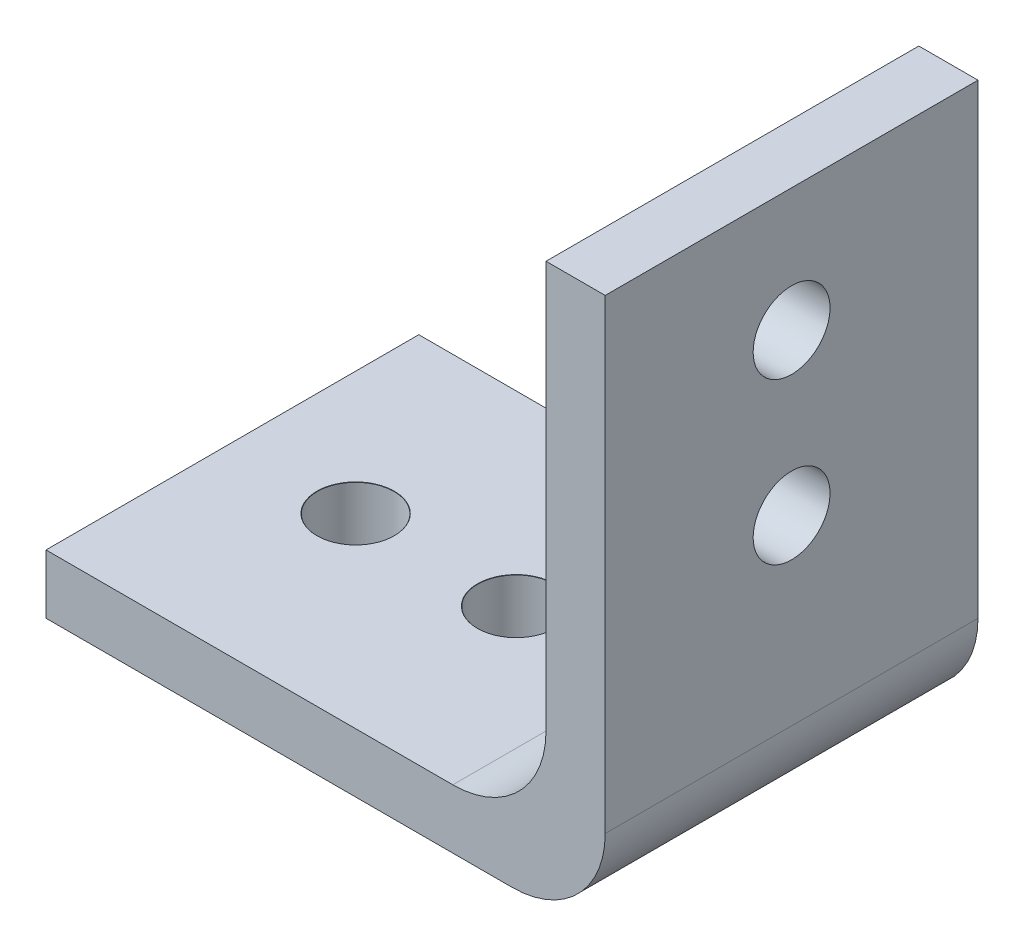
ISO-10303-21;
HEADER;
FILE_DESCRIPTION(('STEP AP214'),'2;1');
FILE_NAME('part.step','',(''),(''),'','','');
FILE_SCHEMA(('AUTOMOTIVE_DESIGN { 1 0 10303 214 1 1 1 1 }'));
ENDSEC;
DATA;
#1=APPLICATION_CONTEXT('core data for automotive mechanical design processes');
#2=APPLICATION_PROTOCOL_DEFINITION('international standard','automotive_design',2000,#1);
#3=PRODUCT_CONTEXT('',#1,'mechanical');
#4=PRODUCT('Part','Part','',(#3));
#5=PRODUCT_RELATED_PRODUCT_CATEGORY('part','',(#4));
#6=PRODUCT_DEFINITION_FORMATION('','',#4);
#7=PRODUCT_DEFINITION_CONTEXT('part definition',#1,'design');
#8=PRODUCT_DEFINITION('design','',#6,#7);
#9=PRODUCT_DEFINITION_SHAPE('','',#8);
#10=(LENGTH_UNIT() NAMED_UNIT(*) SI_UNIT(.MILLI.,.METRE.));
#11=(NAMED_UNIT(*) PLANE_ANGLE_UNIT() SI_UNIT($,.RADIAN.));
#12=(NAMED_UNIT(*) SI_UNIT($,.STERADIAN.) SOLID_ANGLE_UNIT());
#13=UNCERTAINTY_MEASURE_WITH_UNIT(LENGTH_MEASURE(1.E-05),#10,'distance_accuracy_value','');
#14=(GEOMETRIC_REPRESENTATION_CONTEXT(3) GLOBAL_UNCERTAINTY_ASSIGNED_CONTEXT((#13)) GLOBAL_UNIT_ASSIGNED_CONTEXT((#10,
#11,#12)) REPRESENTATION_CONTEXT('',''));
#15=CARTESIAN_POINT('',(0.,0.,0.));
#16=DIRECTION('',(0.,0.,1.));
#17=DIRECTION('',(1.,0.,0.));
#18=AXIS2_PLACEMENT_3D('',#15,#16,#17);
#19=CARTESIAN_POINT('',(-18.3870949784862,6.35,-16.4043299690679));
#20=DIRECTION('',(1.,0.,0.));
#21=DIRECTION('',(0.,0.,-1.));
#22=AXIS2_PLACEMENT_3D('',#19,#20,#21);
#23=PLANE('',#22);
#24=DIRECTION('',(0.,0.,1.));
#25=VECTOR('',#24,1.);
#26=CARTESIAN_POINT('',(-18.3870949784862,0.,-16.4043299690679));
#27=LINE('',#26,#25);
#28=CARTESIAN_POINT('',(-18.3870949784862,0.,-16.4043299690679));
#29=VERTEX_POINT('',#28);
#30=CARTESIAN_POINT('',(-18.3870949784862,0.,23.5956700309321));
#31=VERTEX_POINT('',#30);
#32=EDGE_CURVE('E149',#29,#31,#27,.T.);
#33=ORIENTED_EDGE('',*,*,#32,.T.);
#34=DIRECTION('',(0.,-1.,0.));
#35=VECTOR('',#34,1.);
#36=CARTESIAN_POINT('',(-18.3870949784862,6.35,23.5956700309321));
#37=LINE('',#36,#35);
#38=CARTESIAN_POINT('',(-18.3870949784862,6.35,23.5956700309321));
#39=VERTEX_POINT('',#38);
#40=EDGE_CURVE('E117',#39,#31,#37,.T.);
#41=ORIENTED_EDGE('',*,*,#40,.F.);
#42=DIRECTION('',(0.,0.,1.));
#43=VECTOR('',#42,1.);
#44=CARTESIAN_POINT('',(-18.3870949784862,6.35,-16.4043299690679));
#45=LINE('',#44,#43);
#46=CARTESIAN_POINT('',(-18.3870949784862,6.35,-16.4043299690679));
#47=VERTEX_POINT('',#46);
#48=EDGE_CURVE('E150',#47,#39,#45,.T.);
#49=ORIENTED_EDGE('',*,*,#48,.F.);
#50=DIRECTION('',(0.,-1.,0.));
#51=VECTOR('',#50,1.);
#52=CARTESIAN_POINT('',(-18.3870949784862,6.35,-16.4043299690679));
#53=LINE('',#52,#51);
#54=EDGE_CURVE('E162',#47,#29,#53,.T.);
#55=ORIENTED_EDGE('',*,*,#54,.T.);
#56=EDGE_LOOP('',(#33,#41,#49,#55));
#57=FACE_BOUND('',#56,.T.);
#58=ADVANCED_FACE('F42',(#57),#23,.F.);
#59=CARTESIAN_POINT('',(-18.3870949784862,6.35,23.5956700309321));
#60=DIRECTION('',(0.,0.,-1.));
#61=DIRECTION('',(-1.,0.,0.));
#62=AXIS2_PLACEMENT_3D('',#59,#60,#61);
#63=PLANE('',#62);
#64=DIRECTION('',(1.,0.,0.));
#65=VECTOR('',#64,1.);
#66=CARTESIAN_POINT('',(-18.3870949784862,0.,23.5956700309321));
#67=LINE('',#66,#65);
#68=CARTESIAN_POINT('',(31.6129050215138,0.,23.5956700309321));
#69=VERTEX_POINT('',#68);
#70=EDGE_CURVE('E166',#31,#69,#67,.T.);
#71=ORIENTED_EDGE('',*,*,#70,.T.);
#72=CARTESIAN_POINT('',(31.6129050215138,10.,23.5956700309321));
#73=DIRECTION('',(0.,0.,-1.));
#74=DIRECTION('',(-1.,0.,0.));
#75=AXIS2_PLACEMENT_3D('',#72,#73,#74);
#76=CIRCLE('',#75,10.);
#77=CARTESIAN_POINT('',(41.6129050215138,10.,23.5956700309321));
#78=VERTEX_POINT('',#77);
#79=EDGE_CURVE('E11',#69,#78,#76,.F.);
#80=ORIENTED_EDGE('',*,*,#79,.T.);
#81=DIRECTION('',(0.,-1.,0.));
#82=VECTOR('',#81,1.);
#83=CARTESIAN_POINT('',(41.6129050215138,6.35,23.5956700309321));
#84=LINE('',#83,#82);
#85=CARTESIAN_POINT('',(41.6129050215138,60.,23.5956700309321));
#86=VERTEX_POINT('',#85);
#87=EDGE_CURVE('E106',#86,#78,#84,.T.);
#88=ORIENTED_EDGE('',*,*,#87,.F.);
#89=DIRECTION('',(1.,0.,0.));
#90=VECTOR('',#89,1.);
#91=CARTESIAN_POINT('',(35.2629050215138,60.,23.5956700309321));
#92=LINE('',#91,#90);
#93=CARTESIAN_POINT('',(35.2629050215138,60.,23.5956700309321));
#94=VERTEX_POINT('',#93);
#95=EDGE_CURVE('E110',#94,#86,#92,.T.);
#96=ORIENTED_EDGE('',*,*,#95,.F.);
#97=DIRECTION('',(0.,-1.,0.));
#98=VECTOR('',#97,1.);
#99=CARTESIAN_POINT('',(35.2629050215138,60.,23.5956700309321));
#100=LINE('',#99,#98);
#101=CARTESIAN_POINT('',(35.2629050215138,16.35,23.5956700309321));
#102=VERTEX_POINT('',#101);
#103=EDGE_CURVE('E142',#94,#102,#100,.T.);
#104=ORIENTED_EDGE('',*,*,#103,.T.);
#105=CARTESIAN_POINT('',(25.2629050215138,16.35,23.5956700309321));
#106=DIRECTION('',(0.,0.,-1.));
#107=DIRECTION('',(-1.,0.,0.));
#108=AXIS2_PLACEMENT_3D('',#105,#106,#107);
#109=CIRCLE('',#108,10.);
#110=CARTESIAN_POINT('',(25.2629050215138,6.35,23.5956700309321));
#111=VERTEX_POINT('',#110);
#112=EDGE_CURVE('E186',#102,#111,#109,.T.);
#113=ORIENTED_EDGE('',*,*,#112,.T.);
#114=DIRECTION('',(1.,0.,0.));
#115=VECTOR('',#114,1.);
#116=CARTESIAN_POINT('',(-18.3870949784862,6.35,23.5956700309321));
#117=LINE('',#116,#115);
#118=EDGE_CURVE('E154',#39,#111,#117,.T.);
#119=ORIENTED_EDGE('',*,*,#118,.F.);
#120=ORIENTED_EDGE('',*,*,#40,.T.);
#121=EDGE_LOOP('',(#71,#80,#88,#96,#104,#113,#119,#120));
#122=FACE_BOUND('',#121,.T.);
#123=ADVANCED_FACE('F108',(#122),#63,.F.);
#124=CARTESIAN_POINT('',(41.6129050215138,6.35,-16.4043299690679));
#125=DIRECTION('',(-1.,0.,0.));
#126=DIRECTION('',(0.,0.,1.));
#127=AXIS2_PLACEMENT_3D('',#124,#125,#126);
#128=PLANE('',#127);
#129=CARTESIAN_POINT('',(41.6129050215138,46.78,3.59567003093212));
#130=DIRECTION('',(-1.,0.,0.));
#131=DIRECTION('',(0.,0.,1.));
#132=AXIS2_PLACEMENT_3D('',#129,#130,#131);
#133=CIRCLE('',#132,4.125);
#134=CARTESIAN_POINT('',(41.6129050215138,46.78,7.72067003093211));
#135=VERTEX_POINT('',#134);
#136=EDGE_CURVE('E283',#135,#135,#133,.T.);
#137=ORIENTED_EDGE('',*,*,#136,.T.);
#138=EDGE_LOOP('',(#137));
#139=FACE_BOUND('',#138,.T.);
#140=CARTESIAN_POINT('',(41.6129050215138,29.56,3.59567003093212));
#141=DIRECTION('',(-1.,0.,0.));
#142=DIRECTION('',(0.,0.,1.));
#143=AXIS2_PLACEMENT_3D('',#140,#141,#142);
#144=CIRCLE('',#143,4.125);
#145=CARTESIAN_POINT('',(41.6129050215138,29.56,7.72067003093211));
#146=VERTEX_POINT('',#145);
#147=EDGE_CURVE('E297',#146,#146,#144,.T.);
#148=ORIENTED_EDGE('',*,*,#147,.T.);
#149=EDGE_LOOP('',(#148));
#150=FACE_BOUND('',#149,.T.);
#151=ORIENTED_EDGE('',*,*,#87,.T.);
#152=DIRECTION('',(0.,0.,-1.));
#153=VECTOR('',#152,1.);
#154=CARTESIAN_POINT('',(41.6129050215138,10.,-16.4043299690679));
#155=LINE('',#154,#153);
#156=CARTESIAN_POINT('',(41.6129050215138,10.,-16.4043299690679));
#157=VERTEX_POINT('',#156);
#158=EDGE_CURVE('E192',#78,#157,#155,.T.);
#159=ORIENTED_EDGE('',*,*,#158,.T.);
#160=DIRECTION('',(0.,-1.,0.));
#161=VECTOR('',#160,1.);
#162=CARTESIAN_POINT('',(41.6129050215138,6.35,-16.4043299690679));
#163=LINE('',#162,#161);
#164=CARTESIAN_POINT('',(41.6129050215138,60.,-16.4043299690679));
#165=VERTEX_POINT('',#164);
#166=EDGE_CURVE('E118',#165,#157,#163,.T.);
#167=ORIENTED_EDGE('',*,*,#166,.F.);
#168=DIRECTION('',(0.,0.,1.));
#169=VECTOR('',#168,1.);
#170=CARTESIAN_POINT('',(41.6129050215138,60.,-16.4043299690679));
#171=LINE('',#170,#169);
#172=EDGE_CURVE('E124',#165,#86,#171,.T.);
#173=ORIENTED_EDGE('',*,*,#172,.T.);
#174=EDGE_LOOP('',(#151,#159,#167,#173));
#175=FACE_BOUND('',#174,.T.);
#176=ADVANCED_FACE('F132',(#139,#150,#175),#128,.F.);
#177=CARTESIAN_POINT('',(-18.3870949784862,6.35,-16.4043299690679));
#178=DIRECTION('',(0.,0.,1.));
#179=DIRECTION('',(1.,0.,0.));
#180=AXIS2_PLACEMENT_3D('',#177,#178,#179);
#181=PLANE('',#180);
#182=ORIENTED_EDGE('',*,*,#166,.T.);
#183=CARTESIAN_POINT('',(31.6129050215138,10.,-16.4043299690679));
#184=DIRECTION('',(0.,0.,1.));
#185=DIRECTION('',(1.,0.,0.));
#186=AXIS2_PLACEMENT_3D('',#183,#184,#185);
#187=CIRCLE('',#186,10.);
#188=CARTESIAN_POINT('',(31.6129050215138,0.,-16.4043299690679));
#189=VERTEX_POINT('',#188);
#190=EDGE_CURVE('E65',#157,#189,#187,.F.);
#191=ORIENTED_EDGE('',*,*,#190,.T.);
#192=DIRECTION('',(-1.,0.,0.));
#193=VECTOR('',#192,1.);
#194=CARTESIAN_POINT('',(-18.3870949784862,0.,-16.4043299690679));
#195=LINE('',#194,#193);
#196=EDGE_CURVE('E155',#189,#29,#195,.T.);
#197=ORIENTED_EDGE('',*,*,#196,.T.);
#198=ORIENTED_EDGE('',*,*,#54,.F.);
#199=DIRECTION('',(-1.,0.,0.));
#200=VECTOR('',#199,1.);
#201=CARTESIAN_POINT('',(-18.3870949784862,6.35,-16.4043299690679));
#202=LINE('',#201,#200);
#203=CARTESIAN_POINT('',(25.2629050215138,6.35,-16.4043299690679));
#204=VERTEX_POINT('',#203);
#205=EDGE_CURVE('E159',#204,#47,#202,.T.);
#206=ORIENTED_EDGE('',*,*,#205,.F.);
#207=CARTESIAN_POINT('',(25.2629050215138,16.35,-16.4043299690679));
#208=DIRECTION('',(0.,0.,1.));
#209=DIRECTION('',(1.,0.,0.));
#210=AXIS2_PLACEMENT_3D('',#207,#208,#209);
#211=CIRCLE('',#210,10.);
#212=CARTESIAN_POINT('',(35.2629050215138,16.35,-16.4043299690679));
#213=VERTEX_POINT('',#212);
#214=EDGE_CURVE('E189',#204,#213,#211,.T.);
#215=ORIENTED_EDGE('',*,*,#214,.T.);
#216=DIRECTION('',(0.,-1.,0.));
#217=VECTOR('',#216,1.);
#218=CARTESIAN_POINT('',(35.2629050215138,60.,-16.4043299690679));
#219=LINE('',#218,#217);
#220=CARTESIAN_POINT('',(35.2629050215138,60.,-16.4043299690679));
#221=VERTEX_POINT('',#220);
#222=EDGE_CURVE('E145',#221,#213,#219,.T.);
#223=ORIENTED_EDGE('',*,*,#222,.F.);
#224=DIRECTION('',(1.,0.,0.));
#225=VECTOR('',#224,1.);
#226=CARTESIAN_POINT('',(35.2629050215138,60.,-16.4043299690679));
#227=LINE('',#226,#225);
#228=EDGE_CURVE('E134',#221,#165,#227,.T.);
#229=ORIENTED_EDGE('',*,*,#228,.T.);
#230=EDGE_LOOP('',(#182,#191,#197,#198,#206,#215,#223,#229));
#231=FACE_BOUND('',#230,.T.);
#232=ADVANCED_FACE('F198',(#231),#181,.F.);
#233=CARTESIAN_POINT('',(0.,6.35,0.));
#234=DIRECTION('',(0.,1.,0.));
#235=DIRECTION('',(0.,0.,1.));
#236=AXIS2_PLACEMENT_3D('',#233,#234,#235);
#237=PLANE('',#236);
#238=CARTESIAN_POINT('',(12.0529050215138,6.35,3.59567003093212));
#239=DIRECTION('',(0.,1.,0.));
#240=DIRECTION('',(0.,0.,1.));
#241=AXIS2_PLACEMENT_3D('',#238,#239,#240);
#242=CIRCLE('',#241,4.15);
#243=CARTESIAN_POINT('',(12.0529050215138,6.35,7.74567003093212));
#244=VERTEX_POINT('',#243);
#245=EDGE_CURVE('E301',#244,#244,#242,.T.);
#246=ORIENTED_EDGE('',*,*,#245,.F.);
#247=EDGE_LOOP('',(#246));
#248=FACE_BOUND('',#247,.T.);
#249=CARTESIAN_POINT('',(-5.16709497848623,6.35,3.59567003093212));
#250=DIRECTION('',(0.,1.,0.));
#251=DIRECTION('',(0.,0.,1.));
#252=AXIS2_PLACEMENT_3D('',#249,#250,#251);
#253=CIRCLE('',#252,4.15);
#254=CARTESIAN_POINT('',(-5.16709497848623,6.35,7.74567003093212));
#255=VERTEX_POINT('',#254);
#256=EDGE_CURVE('E313',#255,#255,#253,.T.);
#257=ORIENTED_EDGE('',*,*,#256,.F.);
#258=EDGE_LOOP('',(#257));
#259=FACE_BOUND('',#258,.T.);
#260=ORIENTED_EDGE('',*,*,#118,.T.);
#261=DIRECTION('',(0.,0.,1.));
#262=VECTOR('',#261,1.);
#263=CARTESIAN_POINT('',(25.2629050215138,6.35,0.));
#264=LINE('',#263,#262);
#265=EDGE_CURVE('E183',#111,#204,#264,.F.);
#266=ORIENTED_EDGE('',*,*,#265,.T.);
#267=ORIENTED_EDGE('',*,*,#205,.T.);
#268=ORIENTED_EDGE('',*,*,#48,.T.);
#269=EDGE_LOOP('',(#260,#266,#267,#268));
#270=FACE_BOUND('',#269,.T.);
#271=ADVANCED_FACE('F207',(#248,#259,#270),#237,.T.);
#272=CARTESIAN_POINT('',(0.,0.,0.));
#273=DIRECTION('',(0.,1.,0.));
#274=DIRECTION('',(0.,0.,1.));
#275=AXIS2_PLACEMENT_3D('',#272,#273,#274);
#276=PLANE('',#275);
#277=CARTESIAN_POINT('',(12.0529050215138,0.,3.59567003093212));
#278=DIRECTION('',(0.,1.,0.));
#279=DIRECTION('',(0.,0.,1.));
#280=AXIS2_PLACEMENT_3D('',#277,#278,#279);
#281=CIRCLE('',#280,4.125);
#282=CARTESIAN_POINT('',(12.0529050215138,0.,7.72067003093211));
#283=VERTEX_POINT('',#282);
#284=EDGE_CURVE('E309',#283,#283,#281,.T.);
#285=ORIENTED_EDGE('',*,*,#284,.T.);
#286=EDGE_LOOP('',(#285));
#287=FACE_BOUND('',#286,.T.);
#288=CARTESIAN_POINT('',(-5.16709497848623,0.,3.59567003093212));
#289=DIRECTION('',(0.,1.,0.));
#290=DIRECTION('',(0.,0.,1.));
#291=AXIS2_PLACEMENT_3D('',#288,#289,#290);
#292=CIRCLE('',#291,4.125);
#293=CARTESIAN_POINT('',(-5.16709497848623,0.,7.72067003093212));
#294=VERTEX_POINT('',#293);
#295=EDGE_CURVE('E130',#294,#294,#292,.T.);
#296=ORIENTED_EDGE('',*,*,#295,.T.);
#297=EDGE_LOOP('',(#296));
#298=FACE_BOUND('',#297,.T.);
#299=ORIENTED_EDGE('',*,*,#196,.F.);
#300=DIRECTION('',(0.,0.,-1.));
#301=VECTOR('',#300,1.);
#302=CARTESIAN_POINT('',(31.6129050215138,0.,0.));
#303=LINE('',#302,#301);
#304=EDGE_CURVE('E51',#189,#69,#303,.F.);
#305=ORIENTED_EDGE('',*,*,#304,.T.);
#306=ORIENTED_EDGE('',*,*,#70,.F.);
#307=ORIENTED_EDGE('',*,*,#32,.F.);
#308=EDGE_LOOP('',(#299,#305,#306,#307));
#309=FACE_BOUND('',#308,.T.);
#310=ADVANCED_FACE('F231',(#287,#298,#309),#276,.F.);
#311=CARTESIAN_POINT('',(35.2629050215138,60.,-16.4043299690679));
#312=DIRECTION('',(1.,0.,0.));
#313=DIRECTION('',(0.,0.,-1.));
#314=AXIS2_PLACEMENT_3D('',#311,#312,#313);
#315=PLANE('',#314);
#316=CARTESIAN_POINT('',(35.2629050215138,46.78,3.59567003093212));
#317=DIRECTION('',(-1.,0.,0.));
#318=DIRECTION('',(0.,0.,1.));
#319=AXIS2_PLACEMENT_3D('',#316,#317,#318);
#320=CIRCLE('',#319,4.15);
#321=CARTESIAN_POINT('',(35.2629050215138,46.78,7.74567003093212));
#322=VERTEX_POINT('',#321);
#323=EDGE_CURVE('E279',#322,#322,#320,.T.);
#324=ORIENTED_EDGE('',*,*,#323,.F.);
#325=EDGE_LOOP('',(#324));
#326=FACE_BOUND('',#325,.T.);
#327=CARTESIAN_POINT('',(35.2629050215138,29.56,3.59567003093212));
#328=DIRECTION('',(-1.,0.,0.));
#329=DIRECTION('',(0.,0.,1.));
#330=AXIS2_PLACEMENT_3D('',#327,#328,#329);
#331=CIRCLE('',#330,4.15);
#332=CARTESIAN_POINT('',(35.2629050215138,29.56,7.74567003093212));
#333=VERTEX_POINT('',#332);
#334=EDGE_CURVE('E289',#333,#333,#331,.T.);
#335=ORIENTED_EDGE('',*,*,#334,.F.);
#336=EDGE_LOOP('',(#335));
#337=FACE_BOUND('',#336,.T.);
#338=ORIENTED_EDGE('',*,*,#222,.T.);
#339=DIRECTION('',(0.,0.,1.));
#340=VECTOR('',#339,1.);
#341=CARTESIAN_POINT('',(35.2629050215138,16.35,-16.4043299690679));
#342=LINE('',#341,#340);
#343=EDGE_CURVE('E179',#213,#102,#342,.T.);
#344=ORIENTED_EDGE('',*,*,#343,.T.);
#345=ORIENTED_EDGE('',*,*,#103,.F.);
#346=DIRECTION('',(0.,0.,1.));
#347=VECTOR('',#346,1.);
#348=CARTESIAN_POINT('',(35.2629050215138,60.,-16.4043299690679));
#349=LINE('',#348,#347);
#350=EDGE_CURVE('E127',#221,#94,#349,.T.);
#351=ORIENTED_EDGE('',*,*,#350,.F.);
#352=EDGE_LOOP('',(#338,#344,#345,#351));
#353=FACE_BOUND('',#352,.T.);
#354=ADVANCED_FACE('F203',(#326,#337,#353),#315,.F.);
#355=CARTESIAN_POINT('',(0.,60.,0.));
#356=DIRECTION('',(0.,-1.,0.));
#357=DIRECTION('',(0.,0.,-1.));
#358=AXIS2_PLACEMENT_3D('',#355,#356,#357);
#359=PLANE('',#358);
#360=ORIENTED_EDGE('',*,*,#95,.T.);
#361=ORIENTED_EDGE('',*,*,#172,.F.);
#362=ORIENTED_EDGE('',*,*,#228,.F.);
#363=ORIENTED_EDGE('',*,*,#350,.T.);
#364=EDGE_LOOP('',(#360,#361,#362,#363));
#365=FACE_BOUND('',#364,.T.);
#366=ADVANCED_FACE('F122',(#365),#359,.F.);
#367=CARTESIAN_POINT('',(25.2629050215138,16.35,-16.4043299690679));
#368=DIRECTION('',(0.,0.,1.));
#369=DIRECTION('',(1.,0.,0.));
#370=AXIS2_PLACEMENT_3D('',#367,#368,#369);
#371=CYLINDRICAL_SURFACE('',#370,10.);
#372=ORIENTED_EDGE('',*,*,#214,.F.);
#373=ORIENTED_EDGE('',*,*,#265,.F.);
#374=ORIENTED_EDGE('',*,*,#112,.F.);
#375=ORIENTED_EDGE('',*,*,#343,.F.);
#376=EDGE_LOOP('',(#372,#373,#374,#375));
#377=FACE_BOUND('',#376,.T.);
#378=ADVANCED_FACE('F210',(#377),#371,.F.);
#379=CARTESIAN_POINT('',(31.6129050215138,10.,-16.4043299690679));
#380=DIRECTION('',(0.,0.,-1.));
#381=DIRECTION('',(-1.,0.,0.));
#382=AXIS2_PLACEMENT_3D('',#379,#380,#381);
#383=CYLINDRICAL_SURFACE('',#382,10.);
#384=ORIENTED_EDGE('',*,*,#79,.F.);
#385=ORIENTED_EDGE('',*,*,#304,.F.);
#386=ORIENTED_EDGE('',*,*,#190,.F.);
#387=ORIENTED_EDGE('',*,*,#158,.F.);
#388=EDGE_LOOP('',(#384,#385,#386,#387));
#389=FACE_BOUND('',#388,.T.);
#390=ADVANCED_FACE('F44',(#389),#383,.T.);
#391=CARTESIAN_POINT('',(-5.16709497848623,6.35,3.59567003093212));
#392=DIRECTION('',(0.,1.,0.));
#393=DIRECTION('',(0.,0.,1.));
#394=AXIS2_PLACEMENT_3D('',#391,#392,#393);
#395=CYLINDRICAL_SURFACE('',#394,4.125);
#396=ORIENTED_EDGE('',*,*,#295,.F.);
#397=EDGE_LOOP('',(#396));
#398=FACE_BOUND('',#397,.T.);
#399=CARTESIAN_POINT('',(-5.16709497848623,6.325,3.59567003093212));
#400=DIRECTION('',(0.,1.,0.));
#401=DIRECTION('',(0.,0.,1.));
#402=AXIS2_PLACEMENT_3D('',#399,#400,#401);
#403=CIRCLE('',#402,4.125);
#404=CARTESIAN_POINT('',(-5.16709497848623,6.325,7.72067003093212));
#405=VERTEX_POINT('',#404);
#406=EDGE_CURVE('E317',#405,#405,#403,.T.);
#407=ORIENTED_EDGE('',*,*,#406,.T.);
#408=EDGE_LOOP('',(#407));
#409=FACE_BOUND('',#408,.T.);
#410=ADVANCED_FACE('F216',(#398,#409),#395,.F.);
#411=CARTESIAN_POINT('',(-5.16709497848623,6.35,3.59567003093212));
#412=DIRECTION('',(0.,1.,0.));
#413=DIRECTION('',(0.,0.,1.));
#414=AXIS2_PLACEMENT_3D('',#411,#412,#413);
#415=CONICAL_SURFACE('',#414,4.15,0.785398163397483);
#416=ORIENTED_EDGE('',*,*,#406,.F.);
#417=EDGE_LOOP('',(#416));
#418=FACE_BOUND('',#417,.T.);
#419=ORIENTED_EDGE('',*,*,#256,.T.);
#420=EDGE_LOOP('',(#419));
#421=FACE_BOUND('',#420,.T.);
#422=ADVANCED_FACE('F243',(#418,#421),#415,.F.);
#423=CARTESIAN_POINT('',(12.0529050215138,6.35,3.59567003093212));
#424=DIRECTION('',(0.,1.,0.));
#425=DIRECTION('',(0.,0.,1.));
#426=AXIS2_PLACEMENT_3D('',#423,#424,#425);
#427=CYLINDRICAL_SURFACE('',#426,4.125);
#428=ORIENTED_EDGE('',*,*,#284,.F.);
#429=EDGE_LOOP('',(#428));
#430=FACE_BOUND('',#429,.T.);
#431=CARTESIAN_POINT('',(12.0529050215138,6.325,3.59567003093212));
#432=DIRECTION('',(0.,1.,0.));
#433=DIRECTION('',(0.,0.,1.));
#434=AXIS2_PLACEMENT_3D('',#431,#432,#433);
#435=CIRCLE('',#434,4.125);
#436=CARTESIAN_POINT('',(12.0529050215138,6.325,7.72067003093212));
#437=VERTEX_POINT('',#436);
#438=EDGE_CURVE('E305',#437,#437,#435,.T.);
#439=ORIENTED_EDGE('',*,*,#438,.T.);
#440=EDGE_LOOP('',(#439));
#441=FACE_BOUND('',#440,.T.);
#442=ADVANCED_FACE('F247',(#430,#441),#427,.F.);
#443=CARTESIAN_POINT('',(12.0529050215138,6.35,3.59567003093212));
#444=DIRECTION('',(0.,1.,0.));
#445=DIRECTION('',(0.,0.,1.));
#446=AXIS2_PLACEMENT_3D('',#443,#444,#445);
#447=CONICAL_SURFACE('',#446,4.15,0.785398163397414);
#448=ORIENTED_EDGE('',*,*,#438,.F.);
#449=EDGE_LOOP('',(#448));
#450=FACE_BOUND('',#449,.T.);
#451=ORIENTED_EDGE('',*,*,#245,.T.);
#452=EDGE_LOOP('',(#451));
#453=FACE_BOUND('',#452,.T.);
#454=ADVANCED_FACE('F251',(#450,#453),#447,.F.);
#455=CARTESIAN_POINT('',(35.2629050215138,29.56,3.59567003093212));
#456=DIRECTION('',(-1.,0.,0.));
#457=DIRECTION('',(0.,0.,1.));
#458=AXIS2_PLACEMENT_3D('',#455,#456,#457);
#459=CYLINDRICAL_SURFACE('',#458,4.12499999999999);
#460=ORIENTED_EDGE('',*,*,#147,.F.);
#461=EDGE_LOOP('',(#460));
#462=FACE_BOUND('',#461,.T.);
#463=CARTESIAN_POINT('',(35.2879050215138,29.56,3.59567003093212));
#464=DIRECTION('',(-1.,0.,0.));
#465=DIRECTION('',(0.,0.,1.));
#466=AXIS2_PLACEMENT_3D('',#463,#464,#465);
#467=CIRCLE('',#466,4.12499999999999);
#468=CARTESIAN_POINT('',(35.2879050215138,29.56,7.72067003093211));
#469=VERTEX_POINT('',#468);
#470=EDGE_CURVE('E293',#469,#469,#467,.T.);
#471=ORIENTED_EDGE('',*,*,#470,.T.);
#472=EDGE_LOOP('',(#471));
#473=FACE_BOUND('',#472,.T.);
#474=ADVANCED_FACE('F255',(#462,#473),#459,.F.);
#475=CARTESIAN_POINT('',(35.2629050215138,29.56,3.59567003093212));
#476=DIRECTION('',(-1.,0.,0.));
#477=DIRECTION('',(0.,0.,1.));
#478=AXIS2_PLACEMENT_3D('',#475,#476,#477);
#479=CONICAL_SURFACE('',#478,4.15,0.785398163397171);
#480=ORIENTED_EDGE('',*,*,#470,.F.);
#481=EDGE_LOOP('',(#480));
#482=FACE_BOUND('',#481,.T.);
#483=ORIENTED_EDGE('',*,*,#334,.T.);
#484=EDGE_LOOP('',(#483));
#485=FACE_BOUND('',#484,.T.);
#486=ADVANCED_FACE('F259',(#482,#485),#479,.F.);
#487=CARTESIAN_POINT('',(35.2629050215138,46.78,3.59567003093212));
#488=DIRECTION('',(-1.,0.,0.));
#489=DIRECTION('',(0.,0.,1.));
#490=AXIS2_PLACEMENT_3D('',#487,#488,#489);
#491=CYLINDRICAL_SURFACE('',#490,4.12499999999999);
#492=ORIENTED_EDGE('',*,*,#136,.F.);
#493=EDGE_LOOP('',(#492));
#494=FACE_BOUND('',#493,.T.);
#495=CARTESIAN_POINT('',(35.2879050215138,46.78,3.59567003093212));
#496=DIRECTION('',(-1.,0.,0.));
#497=DIRECTION('',(0.,0.,1.));
#498=AXIS2_PLACEMENT_3D('',#495,#496,#497);
#499=CIRCLE('',#498,4.12499999999999);
#500=CARTESIAN_POINT('',(35.2879050215138,46.78,7.72067003093211));
#501=VERTEX_POINT('',#500);
#502=EDGE_CURVE('E276',#501,#501,#499,.T.);
#503=ORIENTED_EDGE('',*,*,#502,.T.);
#504=EDGE_LOOP('',(#503));
#505=FACE_BOUND('',#504,.T.);
#506=ADVANCED_FACE('F263',(#494,#505),#491,.F.);
#507=CARTESIAN_POINT('',(35.2629050215138,46.78,3.59567003093212));
#508=DIRECTION('',(-1.,0.,0.));
#509=DIRECTION('',(0.,0.,1.));
#510=AXIS2_PLACEMENT_3D('',#507,#508,#509);
#511=CONICAL_SURFACE('',#510,4.15,0.785398163397171);
#512=ORIENTED_EDGE('',*,*,#502,.F.);
#513=EDGE_LOOP('',(#512));
#514=FACE_BOUND('',#513,.T.);
#515=ORIENTED_EDGE('',*,*,#323,.T.);
#516=EDGE_LOOP('',(#515));
#517=FACE_BOUND('',#516,.T.);
#518=ADVANCED_FACE('F267',(#514,#517),#511,.F.);
#519=CLOSED_SHELL('',(#58,#123,#176,#232,#271,#310,#354,#366,#378,#390,#410,#422,#442,#454,#474,
#486,#506,#518));
#520=MANIFOLD_SOLID_BREP('B2',#519);
#521=ADVANCED_BREP_SHAPE_REPRESENTATION('',(#18,#520),#14);
#522=SHAPE_DEFINITION_REPRESENTATION(#9,#521);
ENDSEC;
END-ISO-10303-21;
